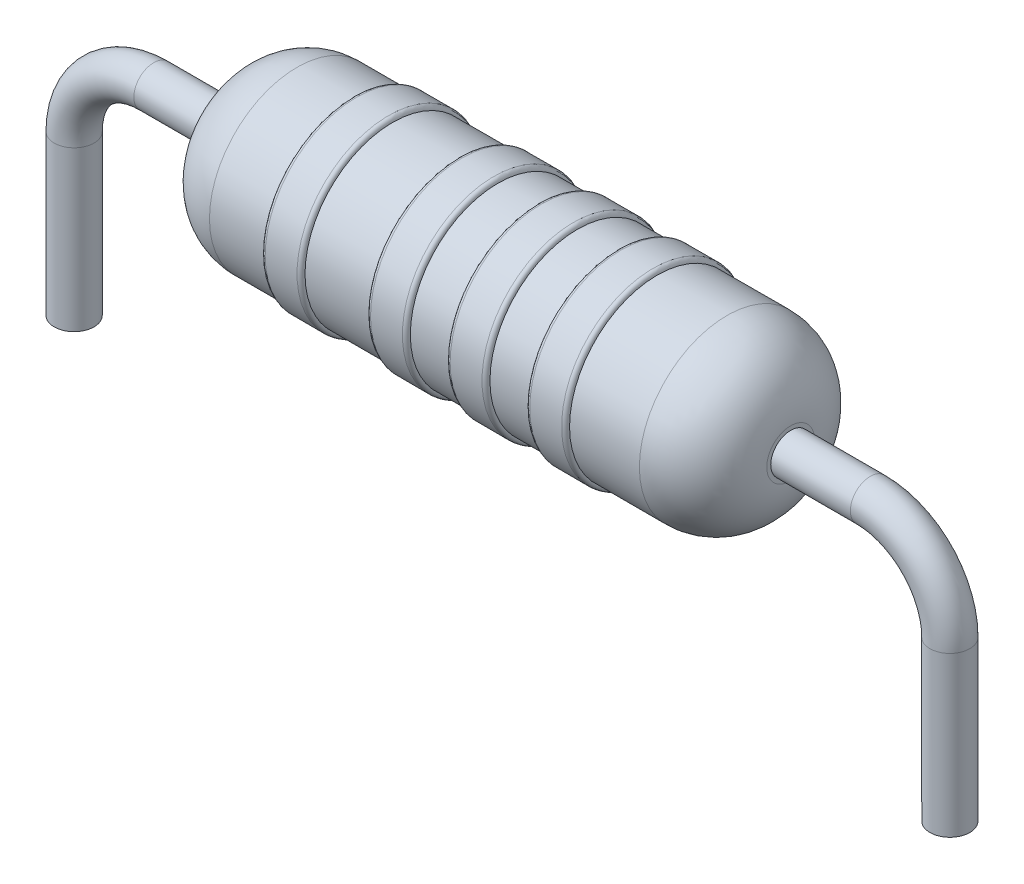
ISO-10303-21;
HEADER;
FILE_DESCRIPTION(('STEP AP214'),'2;1');
FILE_NAME('part.step','',(''),(''),'','','');
FILE_SCHEMA(('AUTOMOTIVE_DESIGN { 1 0 10303 214 1 1 1 1 }'));
ENDSEC;
DATA;
#1=APPLICATION_CONTEXT('core data for automotive mechanical design processes');
#2=APPLICATION_PROTOCOL_DEFINITION('international standard','automotive_design',2000,#1);
#3=PRODUCT_CONTEXT('',#1,'mechanical');
#4=PRODUCT('Part','Part','',(#3));
#5=PRODUCT_RELATED_PRODUCT_CATEGORY('part','',(#4));
#6=PRODUCT_DEFINITION_FORMATION('','',#4);
#7=PRODUCT_DEFINITION_CONTEXT('part definition',#1,'design');
#8=PRODUCT_DEFINITION('design','',#6,#7);
#9=PRODUCT_DEFINITION_SHAPE('','',#8);
#10=(LENGTH_UNIT() NAMED_UNIT(*) SI_UNIT(.MILLI.,.METRE.));
#11=(NAMED_UNIT(*) PLANE_ANGLE_UNIT() SI_UNIT($,.RADIAN.));
#12=(NAMED_UNIT(*) SI_UNIT($,.STERADIAN.) SOLID_ANGLE_UNIT());
#13=UNCERTAINTY_MEASURE_WITH_UNIT(LENGTH_MEASURE(1.E-05),#10,'distance_accuracy_value','');
#14=(GEOMETRIC_REPRESENTATION_CONTEXT(3) GLOBAL_UNCERTAINTY_ASSIGNED_CONTEXT((#13)) GLOBAL_UNIT_ASSIGNED_CONTEXT((#10,
#11,#12)) REPRESENTATION_CONTEXT('',''));
#15=CARTESIAN_POINT('',(0.,0.,0.));
#16=DIRECTION('',(0.,0.,1.));
#17=DIRECTION('',(1.,0.,0.));
#18=AXIS2_PLACEMENT_3D('',#15,#16,#17);
#19=CARTESIAN_POINT('',(-3.5,0.,0.));
#20=DIRECTION('',(1.,0.,0.));
#21=DIRECTION('',(0.,0.,-1.));
#22=AXIS2_PLACEMENT_3D('',#19,#20,#21);
#23=PLANE('',#22);
#24=CARTESIAN_POINT('',(-3.5,0.,0.));
#25=DIRECTION('',(-1.,0.,0.));
#26=DIRECTION('',(0.,0.,1.));
#27=AXIS2_PLACEMENT_3D('',#24,#25,#26);
#28=CIRCLE('',#27,0.299999999999995);
#29=CARTESIAN_POINT('',(-3.5,0.,0.299999999999995));
#30=VERTEX_POINT('',#29);
#31=EDGE_CURVE('E62',#30,#30,#28,.T.);
#32=ORIENTED_EDGE('',*,*,#31,.T.);
#33=EDGE_LOOP('',(#32));
#34=FACE_BOUND('',#33,.T.);
#35=CARTESIAN_POINT('',(-3.5,0.,0.));
#36=DIRECTION('',(-1.,0.,0.));
#37=DIRECTION('',(0.,0.,1.));
#38=AXIS2_PLACEMENT_3D('',#35,#36,#37);
#39=CIRCLE('',#38,0.25);
#40=CARTESIAN_POINT('',(-3.5,0.,0.25));
#41=VERTEX_POINT('',#40);
#42=EDGE_CURVE('E10',#41,#41,#39,.T.);
#43=ORIENTED_EDGE('',*,*,#42,.F.);
#44=EDGE_LOOP('',(#43));
#45=FACE_BOUND('',#44,.T.);
#46=ADVANCED_FACE('F35',(#34,#45),#23,.F.);
#47=CARTESIAN_POINT('',(-54.2686615886834,0.,0.));
#48=DIRECTION('',(-1.,0.,0.));
#49=DIRECTION('',(0.,0.,1.));
#50=AXIS2_PLACEMENT_3D('',#47,#48,#49);
#51=CYLINDRICAL_SURFACE('',#50,1.1);
#52=CARTESIAN_POINT('',(0.322975145638588,0.,0.));
#53=DIRECTION('',(-1.,0.,0.));
#54=DIRECTION('',(0.,0.,1.));
#55=AXIS2_PLACEMENT_3D('',#52,#53,#54);
#56=CIRCLE('',#55,1.1);
#57=CARTESIAN_POINT('',(0.322975145638588,0.,1.1));
#58=VERTEX_POINT('',#57);
#59=EDGE_CURVE('E82',#58,#58,#56,.T.);
#60=ORIENTED_EDGE('',*,*,#59,.T.);
#61=EDGE_LOOP('',(#60));
#62=FACE_BOUND('',#61,.T.);
#63=CARTESIAN_POINT('',(-0.177024854361413,0.,0.));
#64=DIRECTION('',(1.,0.,0.));
#65=DIRECTION('',(0.,0.,-1.));
#66=AXIS2_PLACEMENT_3D('',#63,#64,#65);
#67=CIRCLE('',#66,1.1);
#68=CARTESIAN_POINT('',(-0.177024854361413,0.,-1.1));
#69=VERTEX_POINT('',#68);
#70=EDGE_CURVE('E66',#69,#69,#67,.T.);
#71=ORIENTED_EDGE('',*,*,#70,.T.);
#72=EDGE_LOOP('',(#71));
#73=FACE_BOUND('',#72,.T.);
#74=ADVANCED_FACE('F150',(#62,#73),#51,.T.);
#75=CARTESIAN_POINT('',(4.3261723446646,0.,0.));
#76=DIRECTION('',(1.,0.,0.));
#77=DIRECTION('',(0.,0.,-1.));
#78=AXIS2_PLACEMENT_3D('',#75,#76,#77);
#79=CYLINDRICAL_SURFACE('',#78,1.15);
#80=CARTESIAN_POINT('',(-0.627024854361413,0.,0.));
#81=DIRECTION('',(-1.,0.,0.));
#82=DIRECTION('',(0.,0.,1.));
#83=AXIS2_PLACEMENT_3D('',#80,#81,#82);
#84=CIRCLE('',#83,1.15);
#85=CARTESIAN_POINT('',(-0.627024854361413,0.,1.15));
#86=VERTEX_POINT('',#85);
#87=EDGE_CURVE('E106',#86,#86,#84,.F.);
#88=ORIENTED_EDGE('',*,*,#87,.T.);
#89=EDGE_LOOP('',(#88));
#90=FACE_BOUND('',#89,.T.);
#91=CARTESIAN_POINT('',(-0.227024854361413,0.,0.));
#92=DIRECTION('',(1.,0.,0.));
#93=DIRECTION('',(0.,0.,-1.));
#94=AXIS2_PLACEMENT_3D('',#91,#92,#93);
#95=CIRCLE('',#94,1.15);
#96=CARTESIAN_POINT('',(-0.227024854361413,0.,-1.15));
#97=VERTEX_POINT('',#96);
#98=EDGE_CURVE('E103',#97,#97,#95,.F.);
#99=ORIENTED_EDGE('',*,*,#98,.T.);
#100=EDGE_LOOP('',(#99));
#101=FACE_BOUND('',#100,.T.);
#102=ADVANCED_FACE('F156',(#90,#101),#79,.T.);
#103=CARTESIAN_POINT('',(-1.5,0.,0.));
#104=DIRECTION('',(1.,0.,0.));
#105=DIRECTION('',(0.,0.,-1.));
#106=AXIS2_PLACEMENT_3D('',#103,#104,#105);
#107=CIRCLE('',#106,1.1);
#108=CARTESIAN_POINT('',(-1.5,0.,-1.1));
#109=VERTEX_POINT('',#108);
#110=EDGE_CURVE('E61',#109,#109,#107,.T.);
#111=ORIENTED_EDGE('',*,*,#110,.T.);
#112=EDGE_LOOP('',(#111));
#113=FACE_BOUND('',#112,.T.);
#114=CARTESIAN_POINT('',(-0.677024854361413,0.,0.));
#115=DIRECTION('',(-1.,0.,0.));
#116=DIRECTION('',(0.,0.,1.));
#117=AXIS2_PLACEMENT_3D('',#114,#115,#116);
#118=CIRCLE('',#117,1.1);
#119=CARTESIAN_POINT('',(-0.677024854361413,0.,1.1));
#120=VERTEX_POINT('',#119);
#121=EDGE_CURVE('E76',#120,#120,#118,.T.);
#122=ORIENTED_EDGE('',*,*,#121,.T.);
#123=EDGE_LOOP('',(#122));
#124=FACE_BOUND('',#123,.T.);
#125=ADVANCED_FACE('F158',(#113,#124),#51,.T.);
#126=CARTESIAN_POINT('',(4.3261723446646,0.,0.));
#127=DIRECTION('',(1.,0.,0.));
#128=DIRECTION('',(0.,0.,-1.));
#129=AXIS2_PLACEMENT_3D('',#126,#127,#128);
#130=CYLINDRICAL_SURFACE('',#129,1.15);
#131=CARTESIAN_POINT('',(0.372975145638587,0.,0.));
#132=DIRECTION('',(-1.,0.,0.));
#133=DIRECTION('',(0.,0.,1.));
#134=AXIS2_PLACEMENT_3D('',#131,#132,#133);
#135=CIRCLE('',#134,1.15);
#136=CARTESIAN_POINT('',(0.372975145638587,0.,1.15));
#137=VERTEX_POINT('',#136);
#138=EDGE_CURVE('E112',#137,#137,#135,.F.);
#139=ORIENTED_EDGE('',*,*,#138,.T.);
#140=EDGE_LOOP('',(#139));
#141=FACE_BOUND('',#140,.T.);
#142=CARTESIAN_POINT('',(0.772975145638587,0.,0.));
#143=DIRECTION('',(1.,0.,0.));
#144=DIRECTION('',(0.,0.,-1.));
#145=AXIS2_PLACEMENT_3D('',#142,#143,#144);
#146=CIRCLE('',#145,1.15);
#147=CARTESIAN_POINT('',(0.772975145638587,0.,-1.15));
#148=VERTEX_POINT('',#147);
#149=EDGE_CURVE('E109',#148,#148,#146,.F.);
#150=ORIENTED_EDGE('',*,*,#149,.T.);
#151=EDGE_LOOP('',(#150));
#152=FACE_BOUND('',#151,.T.);
#153=ADVANCED_FACE('F167',(#141,#152),#130,.T.);
#154=CARTESIAN_POINT('',(1.32297514563859,0.,0.));
#155=DIRECTION('',(-1.,0.,0.));
#156=DIRECTION('',(0.,0.,1.));
#157=AXIS2_PLACEMENT_3D('',#154,#155,#156);
#158=CIRCLE('',#157,1.1);
#159=CARTESIAN_POINT('',(1.32297514563859,0.,1.1));
#160=VERTEX_POINT('',#159);
#161=EDGE_CURVE('E88',#160,#160,#158,.T.);
#162=ORIENTED_EDGE('',*,*,#161,.T.);
#163=EDGE_LOOP('',(#162));
#164=FACE_BOUND('',#163,.T.);
#165=CARTESIAN_POINT('',(0.822975145638588,0.,0.));
#166=DIRECTION('',(1.,0.,0.));
#167=DIRECTION('',(0.,0.,-1.));
#168=AXIS2_PLACEMENT_3D('',#165,#166,#167);
#169=CIRCLE('',#168,1.1);
#170=CARTESIAN_POINT('',(0.822975145638588,0.,-1.1));
#171=VERTEX_POINT('',#170);
#172=EDGE_CURVE('E79',#171,#171,#169,.T.);
#173=ORIENTED_EDGE('',*,*,#172,.T.);
#174=EDGE_LOOP('',(#173));
#175=FACE_BOUND('',#174,.T.);
#176=ADVANCED_FACE('F133',(#164,#175),#51,.T.);
#177=CARTESIAN_POINT('',(4.3261723446646,0.,0.));
#178=DIRECTION('',(1.,0.,0.));
#179=DIRECTION('',(0.,0.,-1.));
#180=AXIS2_PLACEMENT_3D('',#177,#178,#179);
#181=CYLINDRICAL_SURFACE('',#180,1.15);
#182=CARTESIAN_POINT('',(1.37297514563859,0.,0.));
#183=DIRECTION('',(-1.,0.,0.));
#184=DIRECTION('',(0.,0.,1.));
#185=AXIS2_PLACEMENT_3D('',#182,#183,#184);
#186=CIRCLE('',#185,1.15);
#187=CARTESIAN_POINT('',(1.37297514563859,0.,1.15));
#188=VERTEX_POINT('',#187);
#189=EDGE_CURVE('E39',#188,#188,#186,.F.);
#190=ORIENTED_EDGE('',*,*,#189,.T.);
#191=EDGE_LOOP('',(#190));
#192=FACE_BOUND('',#191,.T.);
#193=CARTESIAN_POINT('',(1.77297514563859,0.,0.));
#194=DIRECTION('',(1.,0.,0.));
#195=DIRECTION('',(0.,0.,-1.));
#196=AXIS2_PLACEMENT_3D('',#193,#194,#195);
#197=CIRCLE('',#196,1.15);
#198=CARTESIAN_POINT('',(1.77297514563859,0.,-1.15));
#199=VERTEX_POINT('',#198);
#200=EDGE_CURVE('E47',#199,#199,#197,.F.);
#201=ORIENTED_EDGE('',*,*,#200,.T.);
#202=EDGE_LOOP('',(#201));
#203=FACE_BOUND('',#202,.T.);
#204=ADVANCED_FACE('F117',(#192,#203),#181,.T.);
#205=CARTESIAN_POINT('',(3.5,0.299999999999995,0.));
#206=DIRECTION('',(-1.,0.,0.));
#207=DIRECTION('',(0.,0.,1.));
#208=AXIS2_PLACEMENT_3D('',#205,#206,#207);
#209=PLANE('',#208);
#210=CARTESIAN_POINT('',(3.5,0.,0.));
#211=DIRECTION('',(-1.,0.,0.));
#212=DIRECTION('',(0.,0.,1.));
#213=AXIS2_PLACEMENT_3D('',#210,#211,#212);
#214=CIRCLE('',#213,0.25);
#215=CARTESIAN_POINT('',(3.5,0.,0.25));
#216=VERTEX_POINT('',#215);
#217=EDGE_CURVE('E264',#216,#216,#214,.T.);
#218=ORIENTED_EDGE('',*,*,#217,.T.);
#219=EDGE_LOOP('',(#218));
#220=FACE_BOUND('',#219,.T.);
#221=CARTESIAN_POINT('',(3.5,0.,0.));
#222=DIRECTION('',(-1.,0.,0.));
#223=DIRECTION('',(0.,0.,1.));
#224=AXIS2_PLACEMENT_3D('',#221,#222,#223);
#225=CIRCLE('',#224,0.299999999999995);
#226=CARTESIAN_POINT('',(3.5,0.,0.299999999999995));
#227=VERTEX_POINT('',#226);
#228=EDGE_CURVE('E72',#227,#227,#225,.T.);
#229=ORIENTED_EDGE('',*,*,#228,.F.);
#230=EDGE_LOOP('',(#229));
#231=FACE_BOUND('',#230,.T.);
#232=ADVANCED_FACE('F37',(#220,#231),#209,.F.);
#233=CARTESIAN_POINT('',(2.7,0.,0.));
#234=DIRECTION('',(-1.,0.,0.));
#235=DIRECTION('',(0.,0.,1.));
#236=AXIS2_PLACEMENT_3D('',#233,#234,#235);
#237=DEGENERATE_TOROIDAL_SURFACE('',#236,0.3,0.8,.T.);
#238=CARTESIAN_POINT('',(2.69999999999999,0.,0.));
#239=DIRECTION('',(-1.,0.,0.));
#240=DIRECTION('',(0.,0.,1.));
#241=AXIS2_PLACEMENT_3D('',#238,#239,#240);
#242=CIRCLE('',#241,1.1);
#243=CARTESIAN_POINT('',(2.69999999999999,0.,1.1));
#244=VERTEX_POINT('',#243);
#245=EDGE_CURVE('E69',#244,#244,#242,.T.);
#246=ORIENTED_EDGE('',*,*,#245,.F.);
#247=EDGE_LOOP('',(#246));
#248=FACE_BOUND('',#247,.T.);
#249=ORIENTED_EDGE('',*,*,#228,.T.);
#250=EDGE_LOOP('',(#249));
#251=FACE_BOUND('',#250,.T.);
#252=ADVANCED_FACE('F131',(#248,#251),#237,.T.);
#253=CARTESIAN_POINT('',(1.82297514563859,0.,0.));
#254=DIRECTION('',(1.,0.,0.));
#255=DIRECTION('',(0.,0.,-1.));
#256=AXIS2_PLACEMENT_3D('',#253,#254,#255);
#257=CIRCLE('',#256,1.1);
#258=CARTESIAN_POINT('',(1.82297514563859,0.,-1.1));
#259=VERTEX_POINT('',#258);
#260=EDGE_CURVE('E85',#259,#259,#257,.T.);
#261=ORIENTED_EDGE('',*,*,#260,.T.);
#262=EDGE_LOOP('',(#261));
#263=FACE_BOUND('',#262,.T.);
#264=ORIENTED_EDGE('',*,*,#245,.T.);
#265=EDGE_LOOP('',(#264));
#266=FACE_BOUND('',#265,.T.);
#267=ADVANCED_FACE('F127',(#263,#266),#51,.T.);
#268=CARTESIAN_POINT('',(4.3261723446646,0.,0.));
#269=DIRECTION('',(1.,0.,0.));
#270=DIRECTION('',(0.,0.,-1.));
#271=AXIS2_PLACEMENT_3D('',#268,#269,#270);
#272=CYLINDRICAL_SURFACE('',#271,1.15);
#273=CARTESIAN_POINT('',(-1.95,0.,0.));
#274=DIRECTION('',(-1.,0.,0.));
#275=DIRECTION('',(0.,0.,1.));
#276=AXIS2_PLACEMENT_3D('',#273,#274,#275);
#277=CIRCLE('',#276,1.15);
#278=CARTESIAN_POINT('',(-1.95,0.,1.15));
#279=VERTEX_POINT('',#278);
#280=EDGE_CURVE('E100',#279,#279,#277,.F.);
#281=ORIENTED_EDGE('',*,*,#280,.T.);
#282=EDGE_LOOP('',(#281));
#283=FACE_BOUND('',#282,.T.);
#284=CARTESIAN_POINT('',(-1.55,0.,0.));
#285=DIRECTION('',(1.,0.,0.));
#286=DIRECTION('',(0.,0.,-1.));
#287=AXIS2_PLACEMENT_3D('',#284,#285,#286);
#288=CIRCLE('',#287,1.15);
#289=CARTESIAN_POINT('',(-1.55,0.,-1.15));
#290=VERTEX_POINT('',#289);
#291=EDGE_CURVE('E75',#290,#290,#288,.F.);
#292=ORIENTED_EDGE('',*,*,#291,.T.);
#293=EDGE_LOOP('',(#292));
#294=FACE_BOUND('',#293,.T.);
#295=ADVANCED_FACE('F130',(#283,#294),#272,.T.);
#296=CARTESIAN_POINT('',(-2.7,0.,0.));
#297=DIRECTION('',(-1.,0.,0.));
#298=DIRECTION('',(0.,0.,1.));
#299=AXIS2_PLACEMENT_3D('',#296,#297,#298);
#300=DEGENERATE_TOROIDAL_SURFACE('',#299,0.3,0.8,.T.);
#301=ORIENTED_EDGE('',*,*,#31,.F.);
#302=EDGE_LOOP('',(#301));
#303=FACE_BOUND('',#302,.T.);
#304=CARTESIAN_POINT('',(-2.69999999999999,0.,0.));
#305=DIRECTION('',(-1.,0.,0.));
#306=DIRECTION('',(0.,0.,1.));
#307=AXIS2_PLACEMENT_3D('',#304,#305,#306);
#308=CIRCLE('',#307,1.1);
#309=CARTESIAN_POINT('',(-2.69999999999999,0.,1.1));
#310=VERTEX_POINT('',#309);
#311=EDGE_CURVE('E65',#310,#310,#308,.T.);
#312=ORIENTED_EDGE('',*,*,#311,.T.);
#313=EDGE_LOOP('',(#312));
#314=FACE_BOUND('',#313,.T.);
#315=ADVANCED_FACE('F163',(#303,#314),#300,.T.);
#316=CARTESIAN_POINT('',(-2.,0.,0.));
#317=DIRECTION('',(-1.,0.,0.));
#318=DIRECTION('',(0.,0.,1.));
#319=AXIS2_PLACEMENT_3D('',#316,#317,#318);
#320=CIRCLE('',#319,1.1);
#321=CARTESIAN_POINT('',(-2.,0.,1.1));
#322=VERTEX_POINT('',#321);
#323=EDGE_CURVE('E91',#322,#322,#320,.T.);
#324=ORIENTED_EDGE('',*,*,#323,.T.);
#325=EDGE_LOOP('',(#324));
#326=FACE_BOUND('',#325,.T.);
#327=ORIENTED_EDGE('',*,*,#311,.F.);
#328=EDGE_LOOP('',(#327));
#329=FACE_BOUND('',#328,.T.);
#330=ADVANCED_FACE('F134',(#326,#329),#51,.T.);
#331=CARTESIAN_POINT('',(-1.95,0.,0.));
#332=DIRECTION('',(-1.,0.,0.));
#333=DIRECTION('',(0.,0.,1.));
#334=AXIS2_PLACEMENT_3D('',#331,#332,#333);
#335=TOROIDAL_SURFACE('',#334,1.1,0.05);
#336=ORIENTED_EDGE('',*,*,#323,.F.);
#337=EDGE_LOOP('',(#336));
#338=FACE_BOUND('',#337,.T.);
#339=ORIENTED_EDGE('',*,*,#280,.F.);
#340=EDGE_LOOP('',(#339));
#341=FACE_BOUND('',#340,.T.);
#342=ADVANCED_FACE('F177',(#338,#341),#335,.T.);
#343=CARTESIAN_POINT('',(-1.55,0.,0.));
#344=DIRECTION('',(1.,0.,0.));
#345=DIRECTION('',(0.,0.,-1.));
#346=AXIS2_PLACEMENT_3D('',#343,#344,#345);
#347=TOROIDAL_SURFACE('',#346,1.1,0.05);
#348=ORIENTED_EDGE('',*,*,#291,.F.);
#349=EDGE_LOOP('',(#348));
#350=FACE_BOUND('',#349,.T.);
#351=ORIENTED_EDGE('',*,*,#110,.F.);
#352=EDGE_LOOP('',(#351));
#353=FACE_BOUND('',#352,.T.);
#354=ADVANCED_FACE('F182',(#350,#353),#347,.T.);
#355=CARTESIAN_POINT('',(-0.627024854361413,0.,0.));
#356=DIRECTION('',(-1.,0.,0.));
#357=DIRECTION('',(0.,0.,1.));
#358=AXIS2_PLACEMENT_3D('',#355,#356,#357);
#359=TOROIDAL_SURFACE('',#358,1.1,0.05);
#360=ORIENTED_EDGE('',*,*,#121,.F.);
#361=EDGE_LOOP('',(#360));
#362=FACE_BOUND('',#361,.T.);
#363=ORIENTED_EDGE('',*,*,#87,.F.);
#364=EDGE_LOOP('',(#363));
#365=FACE_BOUND('',#364,.T.);
#366=ADVANCED_FACE('F199',(#362,#365),#359,.T.);
#367=CARTESIAN_POINT('',(-0.227024854361413,0.,0.));
#368=DIRECTION('',(1.,0.,0.));
#369=DIRECTION('',(0.,0.,-1.));
#370=AXIS2_PLACEMENT_3D('',#367,#368,#369);
#371=TOROIDAL_SURFACE('',#370,1.1,0.05);
#372=ORIENTED_EDGE('',*,*,#98,.F.);
#373=EDGE_LOOP('',(#372));
#374=FACE_BOUND('',#373,.T.);
#375=ORIENTED_EDGE('',*,*,#70,.F.);
#376=EDGE_LOOP('',(#375));
#377=FACE_BOUND('',#376,.T.);
#378=ADVANCED_FACE('F205',(#374,#377),#371,.T.);
#379=CARTESIAN_POINT('',(0.372975145638587,0.,0.));
#380=DIRECTION('',(-1.,0.,0.));
#381=DIRECTION('',(0.,0.,1.));
#382=AXIS2_PLACEMENT_3D('',#379,#380,#381);
#383=TOROIDAL_SURFACE('',#382,1.1,0.05);
#384=ORIENTED_EDGE('',*,*,#59,.F.);
#385=EDGE_LOOP('',(#384));
#386=FACE_BOUND('',#385,.T.);
#387=ORIENTED_EDGE('',*,*,#138,.F.);
#388=EDGE_LOOP('',(#387));
#389=FACE_BOUND('',#388,.T.);
#390=ADVANCED_FACE('F211',(#386,#389),#383,.T.);
#391=CARTESIAN_POINT('',(0.772975145638587,0.,0.));
#392=DIRECTION('',(1.,0.,0.));
#393=DIRECTION('',(0.,0.,-1.));
#394=AXIS2_PLACEMENT_3D('',#391,#392,#393);
#395=TOROIDAL_SURFACE('',#394,1.1,0.05);
#396=ORIENTED_EDGE('',*,*,#149,.F.);
#397=EDGE_LOOP('',(#396));
#398=FACE_BOUND('',#397,.T.);
#399=ORIENTED_EDGE('',*,*,#172,.F.);
#400=EDGE_LOOP('',(#399));
#401=FACE_BOUND('',#400,.T.);
#402=ADVANCED_FACE('F215',(#398,#401),#395,.T.);
#403=CARTESIAN_POINT('',(1.37297514563859,0.,0.));
#404=DIRECTION('',(-1.,0.,0.));
#405=DIRECTION('',(0.,0.,1.));
#406=AXIS2_PLACEMENT_3D('',#403,#404,#405);
#407=TOROIDAL_SURFACE('',#406,1.1,0.05);
#408=ORIENTED_EDGE('',*,*,#161,.F.);
#409=EDGE_LOOP('',(#408));
#410=FACE_BOUND('',#409,.T.);
#411=ORIENTED_EDGE('',*,*,#189,.F.);
#412=EDGE_LOOP('',(#411));
#413=FACE_BOUND('',#412,.T.);
#414=ADVANCED_FACE('F123',(#410,#413),#407,.T.);
#415=CARTESIAN_POINT('',(1.77297514563859,0.,0.));
#416=DIRECTION('',(1.,0.,0.));
#417=DIRECTION('',(0.,0.,-1.));
#418=AXIS2_PLACEMENT_3D('',#415,#416,#417);
#419=TOROIDAL_SURFACE('',#418,1.1,0.05);
#420=ORIENTED_EDGE('',*,*,#200,.F.);
#421=EDGE_LOOP('',(#420));
#422=FACE_BOUND('',#421,.T.);
#423=ORIENTED_EDGE('',*,*,#260,.F.);
#424=EDGE_LOOP('',(#423));
#425=FACE_BOUND('',#424,.T.);
#426=ADVANCED_FACE('F119',(#422,#425),#419,.T.);
#427=CARTESIAN_POINT('',(-5.5,-1.00000000000001,0.));
#428=DIRECTION('',(0.,-1.,0.));
#429=DIRECTION('',(0.,0.,-1.));
#430=AXIS2_PLACEMENT_3D('',#427,#428,#429);
#431=CYLINDRICAL_SURFACE('',#430,0.25);
#432=CARTESIAN_POINT('',(-5.5,-1.00000000000001,0.));
#433=DIRECTION('',(0.,-1.,0.));
#434=DIRECTION('',(0.,0.,1.));
#435=AXIS2_PLACEMENT_3D('',#432,#433,#434);
#436=CIRCLE('',#435,0.25);
#437=CARTESIAN_POINT('',(-5.75,-1.00000000000001,0.));
#438=VERTEX_POINT('',#437);
#439=EDGE_CURVE('E55',#438,#438,#436,.T.);
#440=ORIENTED_EDGE('',*,*,#439,.T.);
#441=EDGE_LOOP('',(#440));
#442=FACE_BOUND('',#441,.T.);
#443=CARTESIAN_POINT('',(-5.5,-3.,0.));
#444=DIRECTION('',(0.,-1.,0.));
#445=DIRECTION('',(0.,0.,1.));
#446=AXIS2_PLACEMENT_3D('',#443,#444,#445);
#447=CIRCLE('',#446,0.25);
#448=CARTESIAN_POINT('',(-5.5,-3.,0.25));
#449=VERTEX_POINT('',#448);
#450=EDGE_CURVE('E58',#449,#449,#447,.T.);
#451=ORIENTED_EDGE('',*,*,#450,.F.);
#452=EDGE_LOOP('',(#451));
#453=FACE_BOUND('',#452,.T.);
#454=ADVANCED_FACE('F122',(#442,#453),#431,.T.);
#455=CARTESIAN_POINT('',(-4.5,-1.,0.));
#456=DIRECTION('',(0.,0.,1.));
#457=DIRECTION('',(1.,0.,0.));
#458=AXIS2_PLACEMENT_3D('',#455,#456,#457);
#459=TOROIDAL_SURFACE('',#458,1.,0.25);
#460=CARTESIAN_POINT('',(-4.49999999999999,0.,0.));
#461=DIRECTION('',(-1.,0.,0.));
#462=DIRECTION('',(0.,0.,1.));
#463=AXIS2_PLACEMENT_3D('',#460,#461,#462);
#464=CIRCLE('',#463,0.25);
#465=CARTESIAN_POINT('',(-4.49999999999999,0.25,0.));
#466=VERTEX_POINT('',#465);
#467=EDGE_CURVE('E52',#466,#466,#464,.T.);
#468=CARTESIAN_POINT('',(-4.5,-1.,0.));
#469=DIRECTION('',(0.,0.,1.));
#470=DIRECTION('',(1.,0.,0.));
#471=AXIS2_PLACEMENT_3D('',#468,#469,#470);
#472=CIRCLE('',#471,1.25);
#473=EDGE_CURVE('',#466,#438,#472,.T.);
#474=ORIENTED_EDGE('',*,*,#467,.T.);
#475=ORIENTED_EDGE('',*,*,#439,.F.);
#476=ORIENTED_EDGE('',*,*,#473,.T.);
#477=ORIENTED_EDGE('',*,*,#473,.F.);
#478=EDGE_LOOP('',(#474,#476,#475,#477));
#479=FACE_BOUND('',#478,.T.);
#480=ADVANCED_FACE('F225',(#479),#459,.T.);
#481=CARTESIAN_POINT('',(-4.49999999999999,0.,0.));
#482=DIRECTION('',(1.,0.,0.));
#483=DIRECTION('',(0.,0.,-1.));
#484=AXIS2_PLACEMENT_3D('',#481,#482,#483);
#485=CYLINDRICAL_SURFACE('',#484,0.25);
#486=ORIENTED_EDGE('',*,*,#467,.F.);
#487=EDGE_LOOP('',(#486));
#488=FACE_BOUND('',#487,.T.);
#489=ORIENTED_EDGE('',*,*,#42,.T.);
#490=EDGE_LOOP('',(#489));
#491=FACE_BOUND('',#490,.T.);
#492=ADVANCED_FACE('F229',(#488,#491),#485,.T.);
#493=CARTESIAN_POINT('',(-5.5,-3.,0.));
#494=DIRECTION('',(0.,-1.,0.));
#495=DIRECTION('',(0.,0.,1.));
#496=AXIS2_PLACEMENT_3D('',#493,#494,#495);
#497=PLANE('',#496);
#498=ORIENTED_EDGE('',*,*,#450,.T.);
#499=EDGE_LOOP('',(#498));
#500=FACE_BOUND('',#499,.T.);
#501=ADVANCED_FACE('F233',(#500),#497,.T.);
#502=CARTESIAN_POINT('',(5.5,-1.00000000000001,0.));
#503=DIRECTION('',(0.,-1.,0.));
#504=DIRECTION('',(0.,0.,-1.));
#505=AXIS2_PLACEMENT_3D('',#502,#503,#504);
#506=CYLINDRICAL_SURFACE('',#505,0.25);
#507=CARTESIAN_POINT('',(5.5,-1.00000000000001,0.));
#508=DIRECTION('',(0.,1.,0.));
#509=DIRECTION('',(0.,0.,1.));
#510=AXIS2_PLACEMENT_3D('',#507,#508,#509);
#511=CIRCLE('',#510,0.25);
#512=CARTESIAN_POINT('',(5.75,-1.00000000000001,0.));
#513=VERTEX_POINT('',#512);
#514=EDGE_CURVE('E258',#513,#513,#511,.T.);
#515=ORIENTED_EDGE('',*,*,#514,.F.);
#516=EDGE_LOOP('',(#515));
#517=FACE_BOUND('',#516,.T.);
#518=CARTESIAN_POINT('',(5.5,-3.,0.));
#519=DIRECTION('',(0.,1.,0.));
#520=DIRECTION('',(0.,0.,1.));
#521=AXIS2_PLACEMENT_3D('',#518,#519,#520);
#522=CIRCLE('',#521,0.25);
#523=CARTESIAN_POINT('',(5.5,-3.,0.25));
#524=VERTEX_POINT('',#523);
#525=EDGE_CURVE('E50',#524,#524,#522,.T.);
#526=ORIENTED_EDGE('',*,*,#525,.T.);
#527=EDGE_LOOP('',(#526));
#528=FACE_BOUND('',#527,.T.);
#529=ADVANCED_FACE('F237',(#517,#528),#506,.T.);
#530=CARTESIAN_POINT('',(4.5,-1.,0.));
#531=DIRECTION('',(0.,0.,-1.));
#532=DIRECTION('',(-1.,0.,0.));
#533=AXIS2_PLACEMENT_3D('',#530,#531,#532);
#534=TOROIDAL_SURFACE('',#533,1.,0.25);
#535=CARTESIAN_POINT('',(4.49999999999999,0.,0.));
#536=DIRECTION('',(-1.,0.,0.));
#537=DIRECTION('',(0.,0.,1.));
#538=AXIS2_PLACEMENT_3D('',#535,#536,#537);
#539=CIRCLE('',#538,0.25);
#540=CARTESIAN_POINT('',(4.49999999999999,0.25,0.));
#541=VERTEX_POINT('',#540);
#542=EDGE_CURVE('E260',#541,#541,#539,.T.);
#543=CARTESIAN_POINT('',(4.5,-1.,0.));
#544=DIRECTION('',(0.,0.,-1.));
#545=DIRECTION('',(-1.,0.,0.));
#546=AXIS2_PLACEMENT_3D('',#543,#544,#545);
#547=CIRCLE('',#546,1.25);
#548=EDGE_CURVE('',#541,#513,#547,.T.);
#549=ORIENTED_EDGE('',*,*,#542,.F.);
#550=ORIENTED_EDGE('',*,*,#514,.T.);
#551=ORIENTED_EDGE('',*,*,#548,.T.);
#552=ORIENTED_EDGE('',*,*,#548,.F.);
#553=EDGE_LOOP('',(#549,#551,#550,#552));
#554=FACE_BOUND('',#553,.T.);
#555=ADVANCED_FACE('F241',(#554),#534,.T.);
#556=CARTESIAN_POINT('',(4.49999999999999,0.,0.));
#557=DIRECTION('',(-1.,0.,0.));
#558=DIRECTION('',(0.,0.,1.));
#559=AXIS2_PLACEMENT_3D('',#556,#557,#558);
#560=CYLINDRICAL_SURFACE('',#559,0.25);
#561=ORIENTED_EDGE('',*,*,#542,.T.);
#562=EDGE_LOOP('',(#561));
#563=FACE_BOUND('',#562,.T.);
#564=ORIENTED_EDGE('',*,*,#217,.F.);
#565=EDGE_LOOP('',(#564));
#566=FACE_BOUND('',#565,.T.);
#567=ADVANCED_FACE('F245',(#563,#566),#560,.T.);
#568=CARTESIAN_POINT('',(5.5,-3.,0.));
#569=DIRECTION('',(0.,-1.,0.));
#570=DIRECTION('',(0.,0.,1.));
#571=AXIS2_PLACEMENT_3D('',#568,#569,#570);
#572=PLANE('',#571);
#573=ORIENTED_EDGE('',*,*,#525,.F.);
#574=EDGE_LOOP('',(#573));
#575=FACE_BOUND('',#574,.T.);
#576=ADVANCED_FACE('F249',(#575),#572,.T.);
#577=CLOSED_SHELL('',(#46,#74,#102,#125,#153,#176,#204,#232,#252,#267,#295,#315,#330,#342,#354,
#366,#378,#390,#402,#414,#426,#454,#480,#492,#501,#529,#555,#567,#576));
#578=MANIFOLD_SOLID_BREP('B2',#577);
#579=ADVANCED_BREP_SHAPE_REPRESENTATION('',(#18,#578),#14);
#580=SHAPE_DEFINITION_REPRESENTATION(#9,#579);
ENDSEC;
END-ISO-10303-21;
